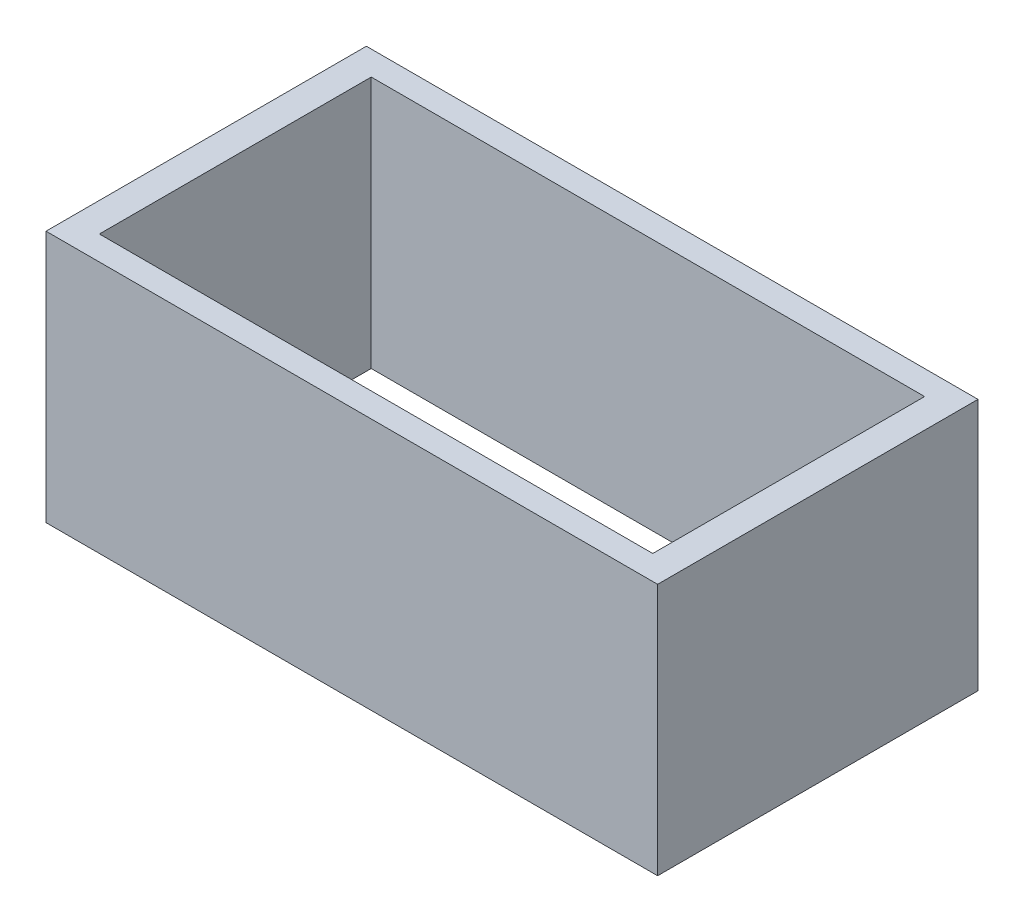
ISO-10303-21;
HEADER;
FILE_DESCRIPTION(('STEP AP214'),'2;1');
FILE_NAME('part.step','',(''),(''),'','','');
FILE_SCHEMA(('AUTOMOTIVE_DESIGN { 1 0 10303 214 1 1 1 1 }'));
ENDSEC;
DATA;
#1=APPLICATION_CONTEXT('core data for automotive mechanical design processes');
#2=APPLICATION_PROTOCOL_DEFINITION('international standard','automotive_design',2000,#1);
#3=PRODUCT_CONTEXT('',#1,'mechanical');
#4=PRODUCT('Part','Part','',(#3));
#5=PRODUCT_RELATED_PRODUCT_CATEGORY('part','',(#4));
#6=PRODUCT_DEFINITION_FORMATION('','',#4);
#7=PRODUCT_DEFINITION_CONTEXT('part definition',#1,'design');
#8=PRODUCT_DEFINITION('design','',#6,#7);
#9=PRODUCT_DEFINITION_SHAPE('','',#8);
#10=(LENGTH_UNIT() NAMED_UNIT(*) SI_UNIT(.MILLI.,.METRE.));
#11=(NAMED_UNIT(*) PLANE_ANGLE_UNIT() SI_UNIT($,.RADIAN.));
#12=(NAMED_UNIT(*) SI_UNIT($,.STERADIAN.) SOLID_ANGLE_UNIT());
#13=UNCERTAINTY_MEASURE_WITH_UNIT(LENGTH_MEASURE(1.E-05),#10,'distance_accuracy_value','');
#14=(GEOMETRIC_REPRESENTATION_CONTEXT(3) GLOBAL_UNCERTAINTY_ASSIGNED_CONTEXT((#13)) GLOBAL_UNIT_ASSIGNED_CONTEXT((#10,
#11,#12)) REPRESENTATION_CONTEXT('',''));
#15=CARTESIAN_POINT('',(0.,0.,0.));
#16=DIRECTION('',(0.,0.,1.));
#17=DIRECTION('',(1.,0.,0.));
#18=AXIS2_PLACEMENT_3D('',#15,#16,#17);
#19=CARTESIAN_POINT('',(0.,13.,0.));
#20=DIRECTION('',(0.,1.,0.));
#21=DIRECTION('',(0.,0.,1.));
#22=AXIS2_PLACEMENT_3D('',#19,#20,#21);
#23=PLANE('',#22);
#24=DIRECTION('',(0.,0.,1.));
#25=VECTOR('',#24,1.);
#26=CARTESIAN_POINT('',(-14.25,13.,7.));
#27=LINE('',#26,#25);
#28=CARTESIAN_POINT('',(-14.25,13.,-7.));
#29=VERTEX_POINT('',#28);
#30=CARTESIAN_POINT('',(-14.25,13.,7.));
#31=VERTEX_POINT('',#30);
#32=EDGE_CURVE('E128',#29,#31,#27,.T.);
#33=ORIENTED_EDGE('',*,*,#32,.F.);
#34=DIRECTION('',(-1.,0.,0.));
#35=VECTOR('',#34,1.);
#36=CARTESIAN_POINT('',(10.75,13.,-7.));
#37=LINE('',#36,#35);
#38=CARTESIAN_POINT('',(14.25,13.,-7.));
#39=VERTEX_POINT('',#38);
#40=EDGE_CURVE('E126',#39,#29,#37,.T.);
#41=ORIENTED_EDGE('',*,*,#40,.F.);
#42=DIRECTION('',(0.,0.,-1.));
#43=VECTOR('',#42,1.);
#44=CARTESIAN_POINT('',(14.25,13.,7.));
#45=LINE('',#44,#43);
#46=CARTESIAN_POINT('',(14.25,13.,7.));
#47=VERTEX_POINT('',#46);
#48=EDGE_CURVE('E113',#47,#39,#45,.T.);
#49=ORIENTED_EDGE('',*,*,#48,.F.);
#50=DIRECTION('',(1.,0.,0.));
#51=VECTOR('',#50,1.);
#52=CARTESIAN_POINT('',(10.75,13.,7.));
#53=LINE('',#52,#51);
#54=EDGE_CURVE('E48',#31,#47,#53,.T.);
#55=ORIENTED_EDGE('',*,*,#54,.F.);
#56=EDGE_LOOP('',(#33,#41,#49,#55));
#57=FACE_BOUND('',#56,.T.);
#58=DIRECTION('',(0.,0.,1.));
#59=VECTOR('',#58,1.);
#60=CARTESIAN_POINT('',(-15.75,13.,8.25));
#61=LINE('',#60,#59);
#62=CARTESIAN_POINT('',(-15.75,13.,-8.25));
#63=VERTEX_POINT('',#62);
#64=CARTESIAN_POINT('',(-15.75,13.,8.25));
#65=VERTEX_POINT('',#64);
#66=EDGE_CURVE('E144',#63,#65,#61,.T.);
#67=ORIENTED_EDGE('',*,*,#66,.T.);
#68=DIRECTION('',(1.,0.,0.));
#69=VECTOR('',#68,1.);
#70=CARTESIAN_POINT('',(15.75,13.,8.25));
#71=LINE('',#70,#69);
#72=CARTESIAN_POINT('',(15.75,13.,8.25));
#73=VERTEX_POINT('',#72);
#74=EDGE_CURVE('E85',#65,#73,#71,.T.);
#75=ORIENTED_EDGE('',*,*,#74,.T.);
#76=DIRECTION('',(0.,0.,-1.));
#77=VECTOR('',#76,1.);
#78=CARTESIAN_POINT('',(15.75,13.,8.25));
#79=LINE('',#78,#77);
#80=CARTESIAN_POINT('',(15.75,13.,-8.25));
#81=VERTEX_POINT('',#80);
#82=EDGE_CURVE('E147',#73,#81,#79,.T.);
#83=ORIENTED_EDGE('',*,*,#82,.T.);
#84=DIRECTION('',(-1.,0.,0.));
#85=VECTOR('',#84,1.);
#86=CARTESIAN_POINT('',(15.75,13.,-8.25));
#87=LINE('',#86,#85);
#88=EDGE_CURVE('E57',#81,#63,#87,.T.);
#89=ORIENTED_EDGE('',*,*,#88,.T.);
#90=EDGE_LOOP('',(#67,#75,#83,#89));
#91=FACE_BOUND('',#90,.T.);
#92=ADVANCED_FACE('F33',(#57,#91),#23,.T.);
#93=CARTESIAN_POINT('',(0.,0.,0.));
#94=DIRECTION('',(0.,1.,0.));
#95=DIRECTION('',(0.,0.,1.));
#96=AXIS2_PLACEMENT_3D('',#93,#94,#95);
#97=PLANE('',#96);
#98=DIRECTION('',(0.,0.,1.));
#99=VECTOR('',#98,1.);
#100=CARTESIAN_POINT('',(-15.75,0.,8.25));
#101=LINE('',#100,#99);
#102=CARTESIAN_POINT('',(-15.75,0.,-8.25));
#103=VERTEX_POINT('',#102);
#104=CARTESIAN_POINT('',(-15.75,0.,8.25));
#105=VERTEX_POINT('',#104);
#106=EDGE_CURVE('E122',#103,#105,#101,.T.);
#107=ORIENTED_EDGE('',*,*,#106,.F.);
#108=DIRECTION('',(-1.,0.,0.));
#109=VECTOR('',#108,1.);
#110=CARTESIAN_POINT('',(15.75,0.,-8.25));
#111=LINE('',#110,#109);
#112=CARTESIAN_POINT('',(15.75,0.,-8.25));
#113=VERTEX_POINT('',#112);
#114=EDGE_CURVE('E78',#113,#103,#111,.T.);
#115=ORIENTED_EDGE('',*,*,#114,.F.);
#116=DIRECTION('',(0.,0.,-1.));
#117=VECTOR('',#116,1.);
#118=CARTESIAN_POINT('',(15.75,0.,8.25));
#119=LINE('',#118,#117);
#120=CARTESIAN_POINT('',(15.75,0.,8.25));
#121=VERTEX_POINT('',#120);
#122=EDGE_CURVE('E155',#121,#113,#119,.T.);
#123=ORIENTED_EDGE('',*,*,#122,.F.);
#124=DIRECTION('',(1.,0.,0.));
#125=VECTOR('',#124,1.);
#126=CARTESIAN_POINT('',(15.75,0.,8.25));
#127=LINE('',#126,#125);
#128=EDGE_CURVE('E153',#105,#121,#127,.T.);
#129=ORIENTED_EDGE('',*,*,#128,.F.);
#130=EDGE_LOOP('',(#107,#115,#123,#129));
#131=FACE_BOUND('',#130,.T.);
#132=DIRECTION('',(-1.,0.,0.));
#133=VECTOR('',#132,1.);
#134=CARTESIAN_POINT('',(10.75,0.,-7.));
#135=LINE('',#134,#133);
#136=CARTESIAN_POINT('',(14.25,0.,-7.));
#137=VERTEX_POINT('',#136);
#138=CARTESIAN_POINT('',(-14.25,0.,-7.));
#139=VERTEX_POINT('',#138);
#140=EDGE_CURVE('E135',#137,#139,#135,.T.);
#141=ORIENTED_EDGE('',*,*,#140,.T.);
#142=DIRECTION('',(0.,0.,1.));
#143=VECTOR('',#142,1.);
#144=CARTESIAN_POINT('',(-14.25,0.,7.));
#145=LINE('',#144,#143);
#146=CARTESIAN_POINT('',(-14.25,0.,7.));
#147=VERTEX_POINT('',#146);
#148=EDGE_CURVE('E114',#139,#147,#145,.T.);
#149=ORIENTED_EDGE('',*,*,#148,.T.);
#150=DIRECTION('',(1.,0.,0.));
#151=VECTOR('',#150,1.);
#152=CARTESIAN_POINT('',(10.75,0.,7.));
#153=LINE('',#152,#151);
#154=CARTESIAN_POINT('',(14.25,0.,7.));
#155=VERTEX_POINT('',#154);
#156=EDGE_CURVE('E132',#147,#155,#153,.T.);
#157=ORIENTED_EDGE('',*,*,#156,.T.);
#158=DIRECTION('',(0.,0.,-1.));
#159=VECTOR('',#158,1.);
#160=CARTESIAN_POINT('',(14.25,0.,7.));
#161=LINE('',#160,#159);
#162=EDGE_CURVE('E120',#155,#137,#161,.T.);
#163=ORIENTED_EDGE('',*,*,#162,.T.);
#164=EDGE_LOOP('',(#141,#149,#157,#163));
#165=FACE_BOUND('',#164,.T.);
#166=ADVANCED_FACE('F168',(#131,#165),#97,.F.);
#167=CARTESIAN_POINT('',(-15.75,13.,8.25));
#168=DIRECTION('',(1.,0.,0.));
#169=DIRECTION('',(0.,0.,-1.));
#170=AXIS2_PLACEMENT_3D('',#167,#168,#169);
#171=PLANE('',#170);
#172=ORIENTED_EDGE('',*,*,#106,.T.);
#173=DIRECTION('',(0.,-1.,0.));
#174=VECTOR('',#173,1.);
#175=CARTESIAN_POINT('',(-15.75,13.,8.25));
#176=LINE('',#175,#174);
#177=EDGE_CURVE('E11',#65,#105,#176,.T.);
#178=ORIENTED_EDGE('',*,*,#177,.F.);
#179=ORIENTED_EDGE('',*,*,#66,.F.);
#180=DIRECTION('',(0.,-1.,0.));
#181=VECTOR('',#180,1.);
#182=CARTESIAN_POINT('',(-15.75,13.,-8.25));
#183=LINE('',#182,#181);
#184=EDGE_CURVE('E150',#63,#103,#183,.T.);
#185=ORIENTED_EDGE('',*,*,#184,.T.);
#186=EDGE_LOOP('',(#172,#178,#179,#185));
#187=FACE_BOUND('',#186,.T.);
#188=ADVANCED_FACE('F35',(#187),#171,.F.);
#189=CARTESIAN_POINT('',(15.75,13.,8.25));
#190=DIRECTION('',(0.,0.,-1.));
#191=DIRECTION('',(-1.,0.,0.));
#192=AXIS2_PLACEMENT_3D('',#189,#190,#191);
#193=PLANE('',#192);
#194=ORIENTED_EDGE('',*,*,#128,.T.);
#195=DIRECTION('',(0.,-1.,0.));
#196=VECTOR('',#195,1.);
#197=CARTESIAN_POINT('',(15.75,13.,8.25));
#198=LINE('',#197,#196);
#199=EDGE_CURVE('E41',#73,#121,#198,.T.);
#200=ORIENTED_EDGE('',*,*,#199,.F.);
#201=ORIENTED_EDGE('',*,*,#74,.F.);
#202=ORIENTED_EDGE('',*,*,#177,.T.);
#203=EDGE_LOOP('',(#194,#200,#201,#202));
#204=FACE_BOUND('',#203,.T.);
#205=ADVANCED_FACE('F181',(#204),#193,.F.);
#206=CARTESIAN_POINT('',(15.75,13.,8.25));
#207=DIRECTION('',(-1.,0.,0.));
#208=DIRECTION('',(0.,0.,1.));
#209=AXIS2_PLACEMENT_3D('',#206,#207,#208);
#210=PLANE('',#209);
#211=ORIENTED_EDGE('',*,*,#122,.T.);
#212=DIRECTION('',(0.,-1.,0.));
#213=VECTOR('',#212,1.);
#214=CARTESIAN_POINT('',(15.75,13.,-8.25));
#215=LINE('',#214,#213);
#216=EDGE_CURVE('E159',#81,#113,#215,.T.);
#217=ORIENTED_EDGE('',*,*,#216,.F.);
#218=ORIENTED_EDGE('',*,*,#82,.F.);
#219=ORIENTED_EDGE('',*,*,#199,.T.);
#220=EDGE_LOOP('',(#211,#217,#218,#219));
#221=FACE_BOUND('',#220,.T.);
#222=ADVANCED_FACE('F164',(#221),#210,.F.);
#223=CARTESIAN_POINT('',(15.75,13.,-8.25));
#224=DIRECTION('',(0.,0.,1.));
#225=DIRECTION('',(1.,0.,0.));
#226=AXIS2_PLACEMENT_3D('',#223,#224,#225);
#227=PLANE('',#226);
#228=ORIENTED_EDGE('',*,*,#114,.T.);
#229=ORIENTED_EDGE('',*,*,#184,.F.);
#230=ORIENTED_EDGE('',*,*,#88,.F.);
#231=ORIENTED_EDGE('',*,*,#216,.T.);
#232=EDGE_LOOP('',(#228,#229,#230,#231));
#233=FACE_BOUND('',#232,.T.);
#234=ADVANCED_FACE('F173',(#233),#227,.F.);
#235=CARTESIAN_POINT('',(10.75,13.,7.));
#236=DIRECTION('',(0.,0.,-1.));
#237=DIRECTION('',(-1.,0.,0.));
#238=AXIS2_PLACEMENT_3D('',#235,#236,#237);
#239=PLANE('',#238);
#240=ORIENTED_EDGE('',*,*,#156,.F.);
#241=DIRECTION('',(0.,-1.,0.));
#242=VECTOR('',#241,1.);
#243=CARTESIAN_POINT('',(-14.25,13.,7.));
#244=LINE('',#243,#242);
#245=EDGE_CURVE('E111',#31,#147,#244,.T.);
#246=ORIENTED_EDGE('',*,*,#245,.F.);
#247=ORIENTED_EDGE('',*,*,#54,.T.);
#248=DIRECTION('',(0.,-1.,0.));
#249=VECTOR('',#248,1.);
#250=CARTESIAN_POINT('',(14.25,13.,7.));
#251=LINE('',#250,#249);
#252=EDGE_CURVE('E108',#47,#155,#251,.T.);
#253=ORIENTED_EDGE('',*,*,#252,.T.);
#254=EDGE_LOOP('',(#240,#246,#247,#253));
#255=FACE_BOUND('',#254,.T.);
#256=ADVANCED_FACE('F107',(#255),#239,.T.);
#257=CARTESIAN_POINT('',(14.25,13.,7.));
#258=DIRECTION('',(-1.,0.,0.));
#259=DIRECTION('',(0.,0.,1.));
#260=AXIS2_PLACEMENT_3D('',#257,#258,#259);
#261=PLANE('',#260);
#262=ORIENTED_EDGE('',*,*,#162,.F.);
#263=ORIENTED_EDGE('',*,*,#252,.F.);
#264=ORIENTED_EDGE('',*,*,#48,.T.);
#265=DIRECTION('',(0.,-1.,0.));
#266=VECTOR('',#265,1.);
#267=CARTESIAN_POINT('',(14.25,13.,-7.));
#268=LINE('',#267,#266);
#269=EDGE_CURVE('E123',#39,#137,#268,.T.);
#270=ORIENTED_EDGE('',*,*,#269,.T.);
#271=EDGE_LOOP('',(#262,#263,#264,#270));
#272=FACE_BOUND('',#271,.T.);
#273=ADVANCED_FACE('F117',(#272),#261,.T.);
#274=CARTESIAN_POINT('',(10.75,13.,-7.));
#275=DIRECTION('',(0.,0.,1.));
#276=DIRECTION('',(1.,0.,0.));
#277=AXIS2_PLACEMENT_3D('',#274,#275,#276);
#278=PLANE('',#277);
#279=ORIENTED_EDGE('',*,*,#140,.F.);
#280=ORIENTED_EDGE('',*,*,#269,.F.);
#281=ORIENTED_EDGE('',*,*,#40,.T.);
#282=DIRECTION('',(0.,-1.,0.));
#283=VECTOR('',#282,1.);
#284=CARTESIAN_POINT('',(-14.25,13.,-7.));
#285=LINE('',#284,#283);
#286=EDGE_CURVE('E140',#29,#139,#285,.T.);
#287=ORIENTED_EDGE('',*,*,#286,.T.);
#288=EDGE_LOOP('',(#279,#280,#281,#287));
#289=FACE_BOUND('',#288,.T.);
#290=ADVANCED_FACE('F192',(#289),#278,.T.);
#291=CARTESIAN_POINT('',(-14.25,13.,7.));
#292=DIRECTION('',(1.,0.,0.));
#293=DIRECTION('',(0.,0.,-1.));
#294=AXIS2_PLACEMENT_3D('',#291,#292,#293);
#295=PLANE('',#294);
#296=ORIENTED_EDGE('',*,*,#148,.F.);
#297=ORIENTED_EDGE('',*,*,#286,.F.);
#298=ORIENTED_EDGE('',*,*,#32,.T.);
#299=ORIENTED_EDGE('',*,*,#245,.T.);
#300=EDGE_LOOP('',(#296,#297,#298,#299));
#301=FACE_BOUND('',#300,.T.);
#302=ADVANCED_FACE('F195',(#301),#295,.T.);
#303=CLOSED_SHELL('',(#92,#166,#188,#205,#222,#234,#256,#273,#290,#302));
#304=MANIFOLD_SOLID_BREP('B2',#303);
#305=ADVANCED_BREP_SHAPE_REPRESENTATION('',(#18,#304),#14);
#306=SHAPE_DEFINITION_REPRESENTATION(#9,#305);
ENDSEC;
END-ISO-10303-21;
